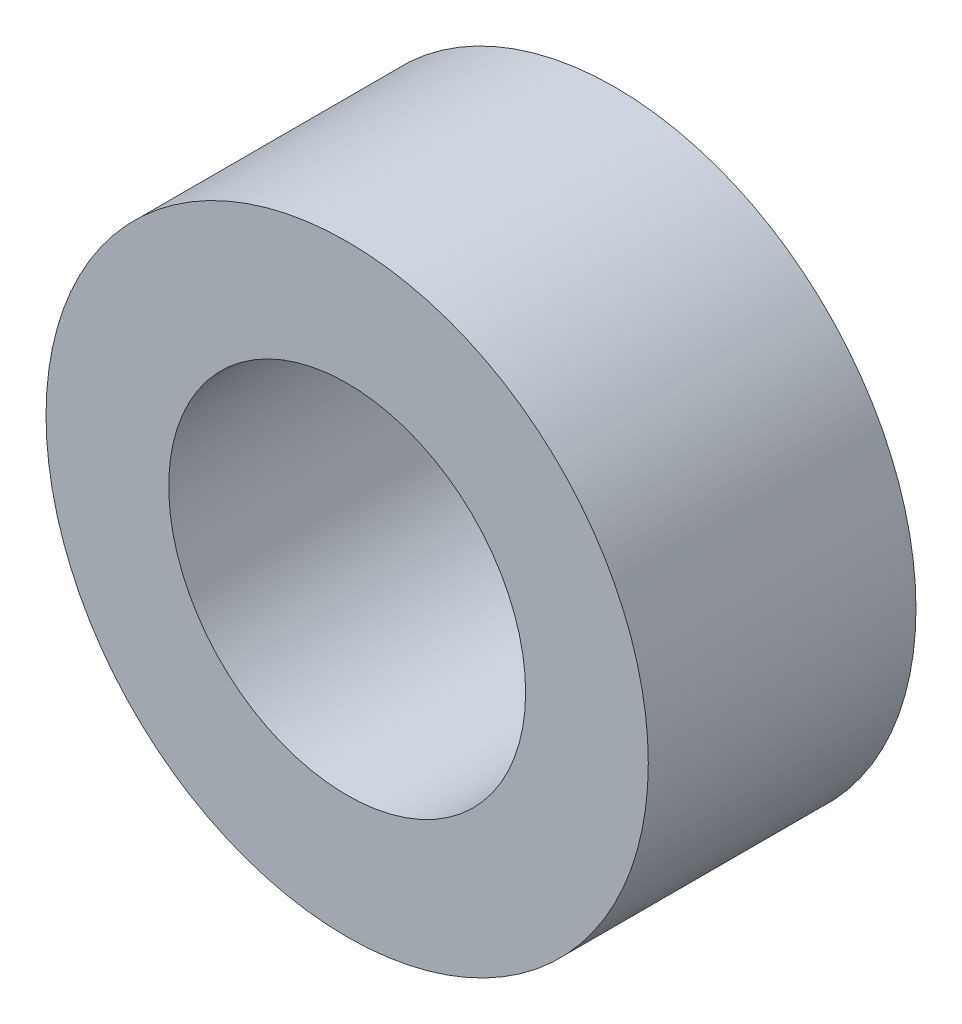
ISO-10303-21;
HEADER;
FILE_DESCRIPTION(('STEP AP214'),'2;1');
FILE_NAME('part.step','',(''),(''),'','','');
FILE_SCHEMA(('AUTOMOTIVE_DESIGN { 1 0 10303 214 1 1 1 1 }'));
ENDSEC;
DATA;
#1=APPLICATION_CONTEXT('core data for automotive mechanical design processes');
#2=APPLICATION_PROTOCOL_DEFINITION('international standard','automotive_design',2000,#1);
#3=PRODUCT_CONTEXT('',#1,'mechanical');
#4=PRODUCT('Part','Part','',(#3));
#5=PRODUCT_RELATED_PRODUCT_CATEGORY('part','',(#4));
#6=PRODUCT_DEFINITION_FORMATION('','',#4);
#7=PRODUCT_DEFINITION_CONTEXT('part definition',#1,'design');
#8=PRODUCT_DEFINITION('design','',#6,#7);
#9=PRODUCT_DEFINITION_SHAPE('','',#8);
#10=(LENGTH_UNIT() NAMED_UNIT(*) SI_UNIT(.MILLI.,.METRE.));
#11=(NAMED_UNIT(*) PLANE_ANGLE_UNIT() SI_UNIT($,.RADIAN.));
#12=(NAMED_UNIT(*) SI_UNIT($,.STERADIAN.) SOLID_ANGLE_UNIT());
#13=UNCERTAINTY_MEASURE_WITH_UNIT(LENGTH_MEASURE(1.E-05),#10,'distance_accuracy_value','');
#14=(GEOMETRIC_REPRESENTATION_CONTEXT(3) GLOBAL_UNCERTAINTY_ASSIGNED_CONTEXT((#13)) GLOBAL_UNIT_ASSIGNED_CONTEXT((#10,
#11,#12)) REPRESENTATION_CONTEXT('',''));
#15=CARTESIAN_POINT('',(0.,0.,0.));
#16=DIRECTION('',(0.,0.,1.));
#17=DIRECTION('',(1.,0.,0.));
#18=AXIS2_PLACEMENT_3D('',#15,#16,#17);
#19=CARTESIAN_POINT('',(0.,0.,84.));
#20=DIRECTION('',(0.,0.,-1.));
#21=DIRECTION('',(-1.,0.,0.));
#22=AXIS2_PLACEMENT_3D('',#19,#20,#21);
#23=CYLINDRICAL_SURFACE('',#22,94.5);
#24=CARTESIAN_POINT('',(0.,0.,84.));
#25=DIRECTION('',(0.,0.,1.));
#26=DIRECTION('',(1.,0.,0.));
#27=AXIS2_PLACEMENT_3D('',#24,#25,#26);
#28=CIRCLE('',#27,94.5);
#29=CARTESIAN_POINT('',(94.5,0.,84.));
#30=VERTEX_POINT('',#29);
#31=EDGE_CURVE('E10',#30,#30,#28,.T.);
#32=ORIENTED_EDGE('',*,*,#31,.F.);
#33=EDGE_LOOP('',(#32));
#34=FACE_BOUND('',#33,.T.);
#35=CARTESIAN_POINT('',(0.,0.,0.));
#36=DIRECTION('',(0.,0.,1.));
#37=DIRECTION('',(1.,0.,0.));
#38=AXIS2_PLACEMENT_3D('',#35,#36,#37);
#39=CIRCLE('',#38,94.5);
#40=CARTESIAN_POINT('',(94.5,0.,0.));
#41=VERTEX_POINT('',#40);
#42=EDGE_CURVE('E40',#41,#41,#39,.T.);
#43=ORIENTED_EDGE('',*,*,#42,.T.);
#44=EDGE_LOOP('',(#43));
#45=FACE_BOUND('',#44,.T.);
#46=ADVANCED_FACE('F37',(#34,#45),#23,.T.);
#47=CARTESIAN_POINT('',(0.,0.,84.));
#48=DIRECTION('',(0.,0.,1.));
#49=DIRECTION('',(1.,0.,0.));
#50=AXIS2_PLACEMENT_3D('',#47,#48,#49);
#51=PLANE('',#50);
#52=CARTESIAN_POINT('',(0.,0.,84.));
#53=DIRECTION('',(0.,0.,1.));
#54=DIRECTION('',(1.,0.,0.));
#55=AXIS2_PLACEMENT_3D('',#52,#53,#54);
#56=CIRCLE('',#55,56.);
#57=CARTESIAN_POINT('',(56.,0.,84.));
#58=VERTEX_POINT('',#57);
#59=EDGE_CURVE('E51',#58,#58,#56,.T.);
#60=ORIENTED_EDGE('',*,*,#59,.F.);
#61=EDGE_LOOP('',(#60));
#62=FACE_BOUND('',#61,.T.);
#63=ORIENTED_EDGE('',*,*,#31,.T.);
#64=EDGE_LOOP('',(#63));
#65=FACE_BOUND('',#64,.T.);
#66=ADVANCED_FACE('F68',(#62,#65),#51,.T.);
#67=CARTESIAN_POINT('',(0.,0.,0.));
#68=DIRECTION('',(0.,0.,1.));
#69=DIRECTION('',(1.,0.,0.));
#70=AXIS2_PLACEMENT_3D('',#67,#68,#69);
#71=PLANE('',#70);
#72=CARTESIAN_POINT('',(0.,0.,0.));
#73=DIRECTION('',(0.,0.,1.));
#74=DIRECTION('',(1.,0.,0.));
#75=AXIS2_PLACEMENT_3D('',#72,#73,#74);
#76=CIRCLE('',#75,56.);
#77=CARTESIAN_POINT('',(56.,0.,0.));
#78=VERTEX_POINT('',#77);
#79=EDGE_CURVE('E49',#78,#78,#76,.T.);
#80=ORIENTED_EDGE('',*,*,#79,.T.);
#81=EDGE_LOOP('',(#80));
#82=FACE_BOUND('',#81,.T.);
#83=ORIENTED_EDGE('',*,*,#42,.F.);
#84=EDGE_LOOP('',(#83));
#85=FACE_BOUND('',#84,.T.);
#86=ADVANCED_FACE('F59',(#82,#85),#71,.F.);
#87=CARTESIAN_POINT('',(0.,0.,0.));
#88=DIRECTION('',(0.,0.,1.));
#89=DIRECTION('',(1.,0.,0.));
#90=AXIS2_PLACEMENT_3D('',#87,#88,#89);
#91=CYLINDRICAL_SURFACE('',#90,56.);
#92=ORIENTED_EDGE('',*,*,#79,.F.);
#93=EDGE_LOOP('',(#92));
#94=FACE_BOUND('',#93,.T.);
#95=ORIENTED_EDGE('',*,*,#59,.T.);
#96=EDGE_LOOP('',(#95));
#97=FACE_BOUND('',#96,.T.);
#98=ADVANCED_FACE('F62',(#94,#97),#91,.F.);
#99=CLOSED_SHELL('',(#46,#66,#86,#98));
#100=MANIFOLD_SOLID_BREP('B2',#99);
#101=ADVANCED_BREP_SHAPE_REPRESENTATION('',(#18,#100),#14);
#102=SHAPE_DEFINITION_REPRESENTATION(#9,#101);
ENDSEC;
END-ISO-10303-21;
